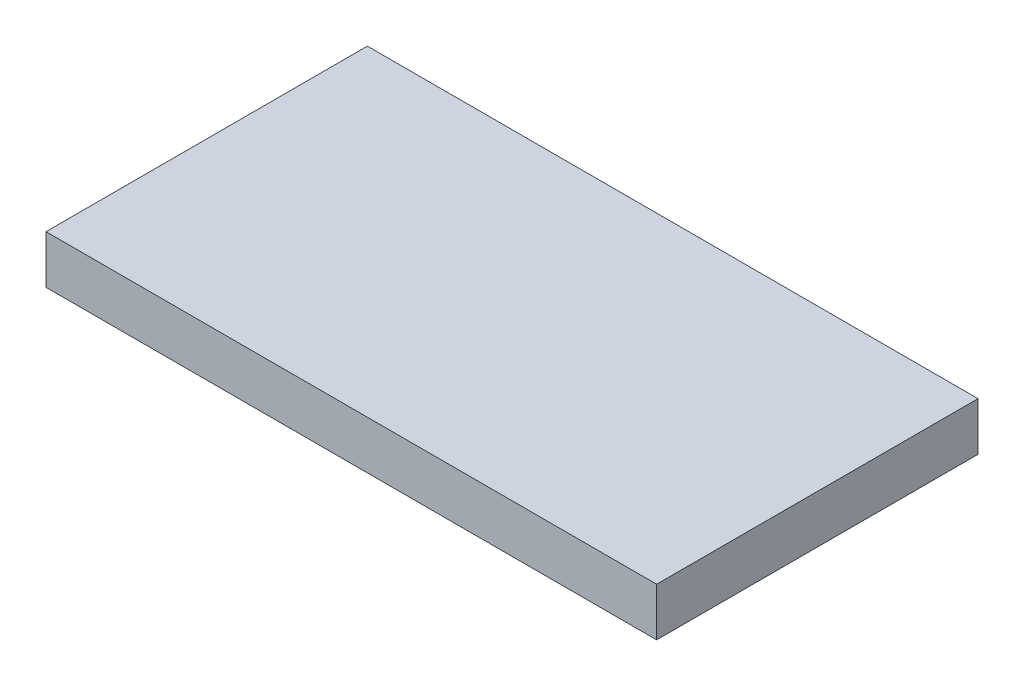
ISO-10303-21;
HEADER;
FILE_DESCRIPTION(('STEP AP214'),'2;1');
FILE_NAME('part.step','',(''),(''),'','','');
FILE_SCHEMA(('AUTOMOTIVE_DESIGN { 1 0 10303 214 1 1 1 1 }'));
ENDSEC;
DATA;
#1=APPLICATION_CONTEXT('core data for automotive mechanical design processes');
#2=APPLICATION_PROTOCOL_DEFINITION('international standard','automotive_design',2000,#1);
#3=PRODUCT_CONTEXT('',#1,'mechanical');
#4=PRODUCT('Part','Part','',(#3));
#5=PRODUCT_RELATED_PRODUCT_CATEGORY('part','',(#4));
#6=PRODUCT_DEFINITION_FORMATION('','',#4);
#7=PRODUCT_DEFINITION_CONTEXT('part definition',#1,'design');
#8=PRODUCT_DEFINITION('design','',#6,#7);
#9=PRODUCT_DEFINITION_SHAPE('','',#8);
#10=(LENGTH_UNIT() NAMED_UNIT(*) SI_UNIT(.MILLI.,.METRE.));
#11=(NAMED_UNIT(*) PLANE_ANGLE_UNIT() SI_UNIT($,.RADIAN.));
#12=(NAMED_UNIT(*) SI_UNIT($,.STERADIAN.) SOLID_ANGLE_UNIT());
#13=UNCERTAINTY_MEASURE_WITH_UNIT(LENGTH_MEASURE(1.E-05),#10,'distance_accuracy_value','');
#14=(GEOMETRIC_REPRESENTATION_CONTEXT(3) GLOBAL_UNCERTAINTY_ASSIGNED_CONTEXT((#13)) GLOBAL_UNIT_ASSIGNED_CONTEXT((#10,
#11,#12)) REPRESENTATION_CONTEXT('',''));
#15=CARTESIAN_POINT('',(0.,0.,0.));
#16=DIRECTION('',(0.,0.,1.));
#17=DIRECTION('',(1.,0.,0.));
#18=AXIS2_PLACEMENT_3D('',#15,#16,#17);
#19=CARTESIAN_POINT('',(0.,0.,0.));
#20=DIRECTION('',(0.,-1.,0.));
#21=DIRECTION('',(0.,0.,-1.));
#22=AXIS2_PLACEMENT_3D('',#19,#20,#21);
#23=PLANE('',#22);
#24=CARTESIAN_POINT('',(261.53147568173,0.,149.954777835148));
#25=DIRECTION('',(0.,1.,0.));
#26=DIRECTION('',(0.,0.,1.));
#27=AXIS2_PLACEMENT_3D('',#24,#25,#26);
#28=CIRCLE('',#27,25.4000000000001);
#29=CARTESIAN_POINT('',(261.53147568173,0.,175.354777835148));
#30=VERTEX_POINT('',#29);
#31=EDGE_CURVE('E178',#30,#30,#28,.T.);
#32=ORIENTED_EDGE('',*,*,#31,.T.);
#33=EDGE_LOOP('',(#32));
#34=FACE_BOUND('',#33,.T.);
#35=CARTESIAN_POINT('',(-246.468524318269,0.,149.954777835148));
#36=DIRECTION('',(0.,-1.,0.));
#37=DIRECTION('',(0.,0.,-1.));
#38=AXIS2_PLACEMENT_3D('',#35,#36,#37);
#39=CIRCLE('',#38,25.3999999999999);
#40=CARTESIAN_POINT('',(-246.468524318269,0.,124.554777835148));
#41=VERTEX_POINT('',#40);
#42=EDGE_CURVE('E179',#41,#41,#39,.T.);
#43=ORIENTED_EDGE('',*,*,#42,.F.);
#44=EDGE_LOOP('',(#43));
#45=FACE_BOUND('',#44,.T.);
#46=DIRECTION('',(0.,0.,-1.));
#47=VECTOR('',#46,1.);
#48=CARTESIAN_POINT('',(-475.068524318269,0.,251.554777835148));
#49=LINE('',#48,#47);
#50=CARTESIAN_POINT('',(-475.068524318269,0.,251.554777835148));
#51=VERTEX_POINT('',#50);
#52=CARTESIAN_POINT('',(-475.068524318269,0.,-256.445222164852));
#53=VERTEX_POINT('',#52);
#54=EDGE_CURVE('E103',#51,#53,#49,.T.);
#55=ORIENTED_EDGE('',*,*,#54,.T.);
#56=DIRECTION('',(1.,0.,0.));
#57=VECTOR('',#56,1.);
#58=CARTESIAN_POINT('',(-475.068524318269,0.,-256.445222164852));
#59=LINE('',#58,#57);
#60=CARTESIAN_POINT('',(490.131475681731,0.,-256.445222164852));
#61=VERTEX_POINT('',#60);
#62=EDGE_CURVE('E106',#53,#61,#59,.T.);
#63=ORIENTED_EDGE('',*,*,#62,.T.);
#64=DIRECTION('',(0.,0.,-1.));
#65=VECTOR('',#64,1.);
#66=CARTESIAN_POINT('',(490.131475681731,0.,251.554777835148));
#67=LINE('',#66,#65);
#68=CARTESIAN_POINT('',(490.131475681731,0.,251.554777835148));
#69=VERTEX_POINT('',#68);
#70=EDGE_CURVE('E94',#69,#61,#67,.T.);
#71=ORIENTED_EDGE('',*,*,#70,.F.);
#72=DIRECTION('',(1.,0.,0.));
#73=VECTOR('',#72,1.);
#74=CARTESIAN_POINT('',(-475.068524318269,0.,251.554777835148));
#75=LINE('',#74,#73);
#76=EDGE_CURVE('E70',#51,#69,#75,.T.);
#77=ORIENTED_EDGE('',*,*,#76,.F.);
#78=EDGE_LOOP('',(#55,#63,#71,#77));
#79=FACE_BOUND('',#78,.T.);
#80=CARTESIAN_POINT('',(261.531475681731,0.,-154.845222164852));
#81=DIRECTION('',(0.,-1.,0.));
#82=DIRECTION('',(0.,0.,-1.));
#83=AXIS2_PLACEMENT_3D('',#80,#81,#82);
#84=CIRCLE('',#83,25.4000000000001);
#85=CARTESIAN_POINT('',(261.531475681731,0.,-180.245222164852));
#86=VERTEX_POINT('',#85);
#87=EDGE_CURVE('E182',#86,#86,#84,.T.);
#88=ORIENTED_EDGE('',*,*,#87,.F.);
#89=EDGE_LOOP('',(#88));
#90=FACE_BOUND('',#89,.T.);
#91=CARTESIAN_POINT('',(-246.468524318269,0.,-154.845222164852));
#92=DIRECTION('',(0.,1.,0.));
#93=DIRECTION('',(0.,0.,1.));
#94=AXIS2_PLACEMENT_3D('',#91,#92,#93);
#95=CIRCLE('',#94,25.4);
#96=CARTESIAN_POINT('',(-246.468524318269,0.,-129.445222164852));
#97=VERTEX_POINT('',#96);
#98=EDGE_CURVE('E190',#97,#97,#95,.T.);
#99=ORIENTED_EDGE('',*,*,#98,.T.);
#100=EDGE_LOOP('',(#99));
#101=FACE_BOUND('',#100,.T.);
#102=ADVANCED_FACE('F36',(#34,#45,#79,#90,#101),#23,.T.);
#103=CARTESIAN_POINT('',(-475.068524318269,76.2,251.554777835148));
#104=DIRECTION('',(-1.,0.,0.));
#105=DIRECTION('',(0.,0.,1.));
#106=AXIS2_PLACEMENT_3D('',#103,#104,#105);
#107=PLANE('',#106);
#108=ORIENTED_EDGE('',*,*,#54,.F.);
#109=DIRECTION('',(0.,-1.,0.));
#110=VECTOR('',#109,1.);
#111=CARTESIAN_POINT('',(-475.068524318269,76.2,251.554777835148));
#112=LINE('',#111,#110);
#113=CARTESIAN_POINT('',(-475.068524318269,76.2,251.554777835148));
#114=VERTEX_POINT('',#113);
#115=EDGE_CURVE('E11',#114,#51,#112,.T.);
#116=ORIENTED_EDGE('',*,*,#115,.F.);
#117=DIRECTION('',(0.,0.,-1.));
#118=VECTOR('',#117,1.);
#119=CARTESIAN_POINT('',(-475.068524318269,76.2,251.554777835148));
#120=LINE('',#119,#118);
#121=CARTESIAN_POINT('',(-475.068524318269,76.2,-256.445222164852));
#122=VERTEX_POINT('',#121);
#123=EDGE_CURVE('E97',#114,#122,#120,.T.);
#124=ORIENTED_EDGE('',*,*,#123,.T.);
#125=DIRECTION('',(0.,-1.,0.));
#126=VECTOR('',#125,1.);
#127=CARTESIAN_POINT('',(-475.068524318269,76.2,-256.445222164852));
#128=LINE('',#127,#126);
#129=EDGE_CURVE('E40',#122,#53,#128,.T.);
#130=ORIENTED_EDGE('',*,*,#129,.T.);
#131=EDGE_LOOP('',(#108,#116,#124,#130));
#132=FACE_BOUND('',#131,.T.);
#133=ADVANCED_FACE('F38',(#132),#107,.T.);
#134=CARTESIAN_POINT('',(-475.068524318269,76.2,251.554777835148));
#135=DIRECTION('',(0.,0.,-1.));
#136=DIRECTION('',(-1.,0.,0.));
#137=AXIS2_PLACEMENT_3D('',#134,#135,#136);
#138=PLANE('',#137);
#139=ORIENTED_EDGE('',*,*,#76,.T.);
#140=DIRECTION('',(0.,-1.,0.));
#141=VECTOR('',#140,1.);
#142=CARTESIAN_POINT('',(490.131475681731,76.2,251.554777835148));
#143=LINE('',#142,#141);
#144=CARTESIAN_POINT('',(490.131475681731,76.2,251.554777835148));
#145=VERTEX_POINT('',#144);
#146=EDGE_CURVE('E46',#145,#69,#143,.T.);
#147=ORIENTED_EDGE('',*,*,#146,.F.);
#148=DIRECTION('',(1.,0.,0.));
#149=VECTOR('',#148,1.);
#150=CARTESIAN_POINT('',(-475.068524318269,76.2,251.554777835148));
#151=LINE('',#150,#149);
#152=EDGE_CURVE('E87',#114,#145,#151,.T.);
#153=ORIENTED_EDGE('',*,*,#152,.F.);
#154=ORIENTED_EDGE('',*,*,#115,.T.);
#155=EDGE_LOOP('',(#139,#147,#153,#154));
#156=FACE_BOUND('',#155,.T.);
#157=ADVANCED_FACE('F114',(#156),#138,.F.);
#158=CARTESIAN_POINT('',(490.131475681731,76.2,251.554777835148));
#159=DIRECTION('',(-1.,0.,0.));
#160=DIRECTION('',(0.,0.,1.));
#161=AXIS2_PLACEMENT_3D('',#158,#159,#160);
#162=PLANE('',#161);
#163=ORIENTED_EDGE('',*,*,#70,.T.);
#164=DIRECTION('',(0.,-1.,0.));
#165=VECTOR('',#164,1.);
#166=CARTESIAN_POINT('',(490.131475681731,76.2,-256.445222164852));
#167=LINE('',#166,#165);
#168=CARTESIAN_POINT('',(490.131475681731,76.2,-256.445222164852));
#169=VERTEX_POINT('',#168);
#170=EDGE_CURVE('E91',#169,#61,#167,.T.);
#171=ORIENTED_EDGE('',*,*,#170,.F.);
#172=DIRECTION('',(0.,0.,-1.));
#173=VECTOR('',#172,1.);
#174=CARTESIAN_POINT('',(490.131475681731,76.2,251.554777835148));
#175=LINE('',#174,#173);
#176=EDGE_CURVE('E82',#145,#169,#175,.T.);
#177=ORIENTED_EDGE('',*,*,#176,.F.);
#178=ORIENTED_EDGE('',*,*,#146,.T.);
#179=EDGE_LOOP('',(#163,#171,#177,#178));
#180=FACE_BOUND('',#179,.T.);
#181=ADVANCED_FACE('F92',(#180),#162,.F.);
#182=CARTESIAN_POINT('',(-475.068524318269,76.2,-256.445222164852));
#183=DIRECTION('',(0.,0.,-1.));
#184=DIRECTION('',(-1.,0.,0.));
#185=AXIS2_PLACEMENT_3D('',#182,#183,#184);
#186=PLANE('',#185);
#187=ORIENTED_EDGE('',*,*,#62,.F.);
#188=ORIENTED_EDGE('',*,*,#129,.F.);
#189=DIRECTION('',(1.,0.,0.));
#190=VECTOR('',#189,1.);
#191=CARTESIAN_POINT('',(-475.068524318269,76.2,-256.445222164852));
#192=LINE('',#191,#190);
#193=EDGE_CURVE('E86',#122,#169,#192,.T.);
#194=ORIENTED_EDGE('',*,*,#193,.T.);
#195=ORIENTED_EDGE('',*,*,#170,.T.);
#196=EDGE_LOOP('',(#187,#188,#194,#195));
#197=FACE_BOUND('',#196,.T.);
#198=ADVANCED_FACE('F96',(#197),#186,.T.);
#199=CARTESIAN_POINT('',(0.,76.2,0.));
#200=DIRECTION('',(0.,-1.,0.));
#201=DIRECTION('',(0.,0.,-1.));
#202=AXIS2_PLACEMENT_3D('',#199,#200,#201);
#203=PLANE('',#202);
#204=ORIENTED_EDGE('',*,*,#123,.F.);
#205=ORIENTED_EDGE('',*,*,#152,.T.);
#206=ORIENTED_EDGE('',*,*,#176,.T.);
#207=ORIENTED_EDGE('',*,*,#193,.F.);
#208=EDGE_LOOP('',(#204,#205,#206,#207));
#209=FACE_BOUND('',#208,.T.);
#210=ADVANCED_FACE('F85',(#209),#203,.F.);
#211=CARTESIAN_POINT('',(-246.468524318269,25.4,149.954777835148));
#212=DIRECTION('',(0.,-1.,0.));
#213=DIRECTION('',(0.,0.,-1.));
#214=AXIS2_PLACEMENT_3D('',#211,#212,#213);
#215=CYLINDRICAL_SURFACE('',#214,25.3999999999999);
#216=CARTESIAN_POINT('',(-246.468524318269,25.4,149.954777835148));
#217=DIRECTION('',(0.,-1.,0.));
#218=DIRECTION('',(0.,0.,-1.));
#219=AXIS2_PLACEMENT_3D('',#216,#217,#218);
#220=CIRCLE('',#219,25.3999999999999);
#221=CARTESIAN_POINT('',(-246.468524318269,25.4,124.554777835148));
#222=VERTEX_POINT('',#221);
#223=EDGE_CURVE('E107',#222,#222,#220,.T.);
#224=ORIENTED_EDGE('',*,*,#223,.F.);
#225=EDGE_LOOP('',(#224));
#226=FACE_BOUND('',#225,.T.);
#227=ORIENTED_EDGE('',*,*,#42,.T.);
#228=EDGE_LOOP('',(#227));
#229=FACE_BOUND('',#228,.T.);
#230=ADVANCED_FACE('F134',(#226,#229),#215,.F.);
#231=CARTESIAN_POINT('',(-246.468524318269,25.4,149.954777835148));
#232=DIRECTION('',(0.,-1.,0.));
#233=DIRECTION('',(0.,0.,-1.));
#234=AXIS2_PLACEMENT_3D('',#231,#232,#233);
#235=PLANE('',#234);
#236=ORIENTED_EDGE('',*,*,#223,.T.);
#237=EDGE_LOOP('',(#236));
#238=FACE_BOUND('',#237,.T.);
#239=ADVANCED_FACE('F138',(#238),#235,.T.);
#240=CARTESIAN_POINT('',(261.53147568173,25.4,149.954777835148));
#241=DIRECTION('',(0.,-1.,0.));
#242=DIRECTION('',(0.,0.,-1.));
#243=AXIS2_PLACEMENT_3D('',#240,#241,#242);
#244=CYLINDRICAL_SURFACE('',#243,25.4000000000001);
#245=CARTESIAN_POINT('',(261.53147568173,25.4,149.954777835148));
#246=DIRECTION('',(0.,1.,0.));
#247=DIRECTION('',(0.,0.,1.));
#248=AXIS2_PLACEMENT_3D('',#245,#246,#247);
#249=CIRCLE('',#248,25.4000000000001);
#250=CARTESIAN_POINT('',(261.53147568173,25.4,175.354777835148));
#251=VERTEX_POINT('',#250);
#252=EDGE_CURVE('E176',#251,#251,#249,.T.);
#253=ORIENTED_EDGE('',*,*,#252,.T.);
#254=EDGE_LOOP('',(#253));
#255=FACE_BOUND('',#254,.T.);
#256=ORIENTED_EDGE('',*,*,#31,.F.);
#257=EDGE_LOOP('',(#256));
#258=FACE_BOUND('',#257,.T.);
#259=ADVANCED_FACE('F143',(#255,#258),#244,.F.);
#260=CARTESIAN_POINT('',(261.53147568173,25.4,149.954777835148));
#261=DIRECTION('',(0.,1.,0.));
#262=DIRECTION('',(0.,0.,1.));
#263=AXIS2_PLACEMENT_3D('',#260,#261,#262);
#264=PLANE('',#263);
#265=ORIENTED_EDGE('',*,*,#252,.F.);
#266=EDGE_LOOP('',(#265));
#267=FACE_BOUND('',#266,.T.);
#268=ADVANCED_FACE('F164',(#267),#264,.F.);
#269=CARTESIAN_POINT('',(261.531475681731,25.4,-154.845222164852));
#270=DIRECTION('',(0.,-1.,0.));
#271=DIRECTION('',(0.,0.,-1.));
#272=AXIS2_PLACEMENT_3D('',#269,#270,#271);
#273=CYLINDRICAL_SURFACE('',#272,25.4000000000001);
#274=CARTESIAN_POINT('',(261.531475681731,25.4,-154.845222164852));
#275=DIRECTION('',(0.,-1.,0.));
#276=DIRECTION('',(0.,0.,-1.));
#277=AXIS2_PLACEMENT_3D('',#274,#275,#276);
#278=CIRCLE('',#277,25.4000000000001);
#279=CARTESIAN_POINT('',(261.531475681731,25.4,-180.245222164852));
#280=VERTEX_POINT('',#279);
#281=EDGE_CURVE('E187',#280,#280,#278,.T.);
#282=ORIENTED_EDGE('',*,*,#281,.F.);
#283=EDGE_LOOP('',(#282));
#284=FACE_BOUND('',#283,.T.);
#285=ORIENTED_EDGE('',*,*,#87,.T.);
#286=EDGE_LOOP('',(#285));
#287=FACE_BOUND('',#286,.T.);
#288=ADVANCED_FACE('F160',(#284,#287),#273,.F.);
#289=CARTESIAN_POINT('',(261.531475681731,25.4,-154.845222164852));
#290=DIRECTION('',(0.,-1.,0.));
#291=DIRECTION('',(0.,0.,-1.));
#292=AXIS2_PLACEMENT_3D('',#289,#290,#291);
#293=PLANE('',#292);
#294=ORIENTED_EDGE('',*,*,#281,.T.);
#295=EDGE_LOOP('',(#294));
#296=FACE_BOUND('',#295,.T.);
#297=ADVANCED_FACE('F156',(#296),#293,.T.);
#298=CARTESIAN_POINT('',(-246.468524318269,25.4,-154.845222164852));
#299=DIRECTION('',(0.,-1.,0.));
#300=DIRECTION('',(0.,0.,-1.));
#301=AXIS2_PLACEMENT_3D('',#298,#299,#300);
#302=CYLINDRICAL_SURFACE('',#301,25.4);
#303=CARTESIAN_POINT('',(-246.468524318269,25.4,-154.845222164852));
#304=DIRECTION('',(0.,1.,0.));
#305=DIRECTION('',(0.,0.,1.));
#306=AXIS2_PLACEMENT_3D('',#303,#304,#305);
#307=CIRCLE('',#306,25.4);
#308=CARTESIAN_POINT('',(-246.468524318269,25.4,-129.445222164852));
#309=VERTEX_POINT('',#308);
#310=EDGE_CURVE('E193',#309,#309,#307,.T.);
#311=ORIENTED_EDGE('',*,*,#310,.T.);
#312=EDGE_LOOP('',(#311));
#313=FACE_BOUND('',#312,.T.);
#314=ORIENTED_EDGE('',*,*,#98,.F.);
#315=EDGE_LOOP('',(#314));
#316=FACE_BOUND('',#315,.T.);
#317=ADVANCED_FACE('F152',(#313,#316),#302,.F.);
#318=CARTESIAN_POINT('',(-246.468524318269,25.4,-154.845222164852));
#319=DIRECTION('',(0.,1.,0.));
#320=DIRECTION('',(0.,0.,1.));
#321=AXIS2_PLACEMENT_3D('',#318,#319,#320);
#322=PLANE('',#321);
#323=ORIENTED_EDGE('',*,*,#310,.F.);
#324=EDGE_LOOP('',(#323));
#325=FACE_BOUND('',#324,.T.);
#326=ADVANCED_FACE('F149',(#325),#322,.F.);
#327=CLOSED_SHELL('',(#102,#133,#157,#181,#198,#210,#230,#239,#259,#268,#288,#297,#317,#326));
#328=MANIFOLD_SOLID_BREP('B2',#327);
#329=ADVANCED_BREP_SHAPE_REPRESENTATION('',(#18,#328),#14);
#330=SHAPE_DEFINITION_REPRESENTATION(#9,#329);
ENDSEC;
END-ISO-10303-21;
